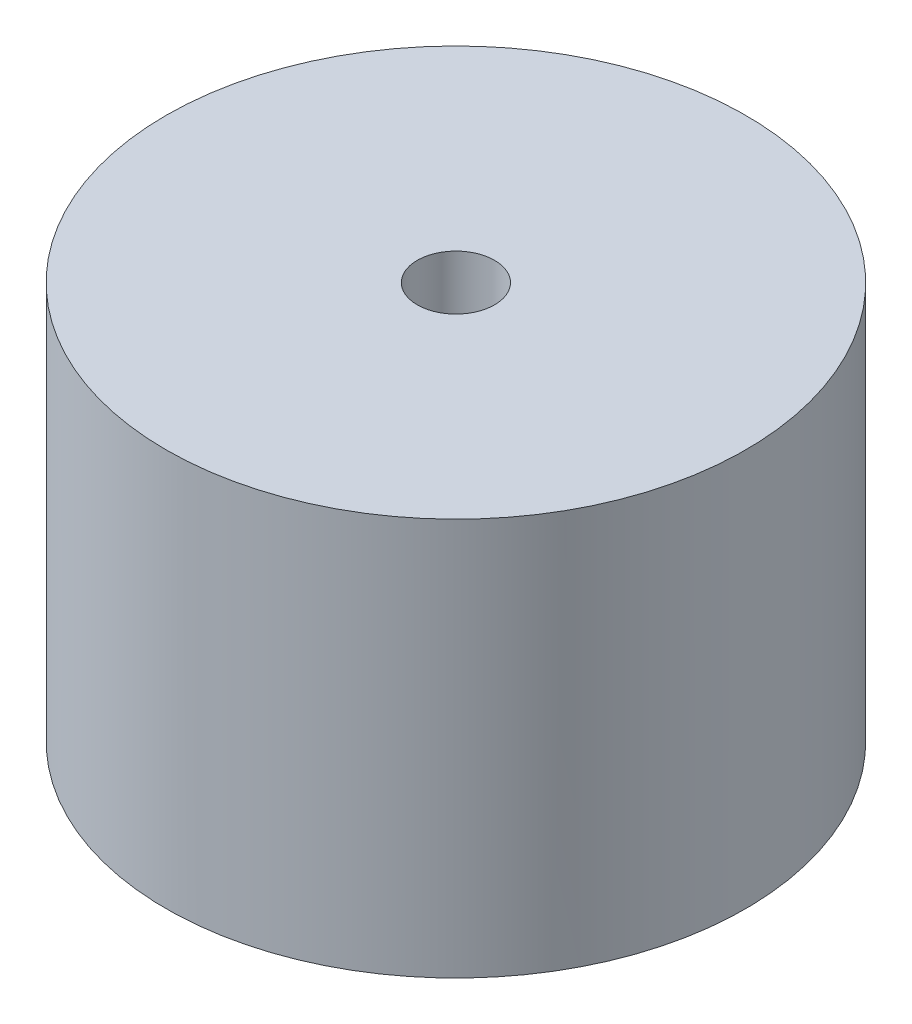
ISO-10303-21;
HEADER;
FILE_DESCRIPTION(('STEP AP214'),'2;1');
FILE_NAME('part.step','',(''),(''),'','','');
FILE_SCHEMA(('AUTOMOTIVE_DESIGN { 1 0 10303 214 1 1 1 1 }'));
ENDSEC;
DATA;
#1=APPLICATION_CONTEXT('core data for automotive mechanical design processes');
#2=APPLICATION_PROTOCOL_DEFINITION('international standard','automotive_design',2000,#1);
#3=PRODUCT_CONTEXT('',#1,'mechanical');
#4=PRODUCT('Part','Part','',(#3));
#5=PRODUCT_RELATED_PRODUCT_CATEGORY('part','',(#4));
#6=PRODUCT_DEFINITION_FORMATION('','',#4);
#7=PRODUCT_DEFINITION_CONTEXT('part definition',#1,'design');
#8=PRODUCT_DEFINITION('design','',#6,#7);
#9=PRODUCT_DEFINITION_SHAPE('','',#8);
#10=(LENGTH_UNIT() NAMED_UNIT(*) SI_UNIT(.MILLI.,.METRE.));
#11=(NAMED_UNIT(*) PLANE_ANGLE_UNIT() SI_UNIT($,.RADIAN.));
#12=(NAMED_UNIT(*) SI_UNIT($,.STERADIAN.) SOLID_ANGLE_UNIT());
#13=UNCERTAINTY_MEASURE_WITH_UNIT(LENGTH_MEASURE(1.E-05),#10,'distance_accuracy_value','');
#14=(GEOMETRIC_REPRESENTATION_CONTEXT(3) GLOBAL_UNCERTAINTY_ASSIGNED_CONTEXT((#13)) GLOBAL_UNIT_ASSIGNED_CONTEXT((#10,
#11,#12)) REPRESENTATION_CONTEXT('',''));
#15=CARTESIAN_POINT('',(0.,0.,0.));
#16=DIRECTION('',(0.,0.,1.));
#17=DIRECTION('',(1.,0.,0.));
#18=AXIS2_PLACEMENT_3D('',#15,#16,#17);
#19=CARTESIAN_POINT('',(0.,0.,0.));
#20=DIRECTION('',(0.,1.,0.));
#21=DIRECTION('',(0.,0.,1.));
#22=AXIS2_PLACEMENT_3D('',#19,#20,#21);
#23=PLANE('',#22);
#24=CARTESIAN_POINT('',(0.,0.,0.));
#25=DIRECTION('',(0.,1.,0.));
#26=DIRECTION('',(0.,0.,1.));
#27=AXIS2_PLACEMENT_3D('',#24,#25,#26);
#28=CIRCLE('',#27,10.125);
#29=CARTESIAN_POINT('',(-9.33487654320988,0.,3.92118667281093));
#30=VERTEX_POINT('',#29);
#31=CARTESIAN_POINT('',(-10.125,0.,0.));
#32=VERTEX_POINT('',#31);
#33=EDGE_CURVE('E98',#30,#32,#28,.T.);
#34=ORIENTED_EDGE('',*,*,#33,.T.);
#35=DIRECTION('',(1.,0.,0.));
#36=VECTOR('',#35,1.);
#37=CARTESIAN_POINT('',(-13.125,0.,0.));
#38=LINE('',#37,#36);
#39=CARTESIAN_POINT('',(-13.125,0.,0.));
#40=VERTEX_POINT('',#39);
#41=EDGE_CURVE('E101',#40,#32,#38,.T.);
#42=ORIENTED_EDGE('',*,*,#41,.F.);
#43=CARTESIAN_POINT('',(0.,0.,0.));
#44=DIRECTION('',(0.,1.,0.));
#45=DIRECTION('',(0.,0.,1.));
#46=AXIS2_PLACEMENT_3D('',#43,#44,#45);
#47=CIRCLE('',#46,13.125);
#48=CARTESIAN_POINT('',(-12.1007658893461,0.,5.0830197610512));
#49=VERTEX_POINT('',#48);
#50=EDGE_CURVE('E100',#49,#40,#47,.T.);
#51=ORIENTED_EDGE('',*,*,#50,.F.);
#52=DIRECTION('',(-0.921963115378753,0.,0.387277696080091));
#53=VECTOR('',#52,1.);
#54=CARTESIAN_POINT('',(-9.33487654320988,0.,3.92118667281093));
#55=LINE('',#54,#53);
#56=EDGE_CURVE('E87',#30,#49,#55,.T.);
#57=ORIENTED_EDGE('',*,*,#56,.F.);
#58=EDGE_LOOP('',(#34,#42,#51,#57));
#59=FACE_BOUND('',#58,.T.);
#60=ADVANCED_FACE('F32',(#59),#23,.F.);
#61=CARTESIAN_POINT('',(0.,15.,0.));
#62=DIRECTION('',(0.,-1.,0.));
#63=DIRECTION('',(0.,0.,-1.));
#64=AXIS2_PLACEMENT_3D('',#61,#62,#63);
#65=CYLINDRICAL_SURFACE('',#64,13.125);
#66=ORIENTED_EDGE('',*,*,#50,.T.);
#67=DIRECTION('',(0.,-1.,0.));
#68=VECTOR('',#67,1.);
#69=CARTESIAN_POINT('',(-13.125,14.,0.));
#70=LINE('',#69,#68);
#71=CARTESIAN_POINT('',(-13.125,12.,0.));
#72=VERTEX_POINT('',#71);
#73=EDGE_CURVE('E156',#72,#40,#70,.T.);
#74=ORIENTED_EDGE('',*,*,#73,.F.);
#75=CARTESIAN_POINT('',(-13.125,12.,0.));
#76=CARTESIAN_POINT('',(-13.1249979172739,12.0562565794863,3.75859197750886E-07));
#77=CARTESIAN_POINT('',(-13.1250002341584,12.1124862113975,0.00237509100152606));
#78=CARTESIAN_POINT('',(-13.1249959122492,12.224543341875,0.0118488139434572));
#79=CARTESIAN_POINT('',(-13.1249892738763,12.2803708592129,0.0189475997516464));
#80=CARTESIAN_POINT('',(-13.1249293619367,12.4465574299383,0.0472634185741115));
#81=CARTESIAN_POINT('',(-13.1248361989639,12.5558037446611,0.0755000947390068));
#82=CARTESIAN_POINT('',(-13.1241959827581,12.7680042654917,0.149909547006922));
#83=CARTESIAN_POINT('',(-13.1236487057189,12.8709553421784,0.196091161149244));
#84=CARTESIAN_POINT('',(-13.121566783017,13.067636122444,0.305071441018353));
#85=CARTESIAN_POINT('',(-13.1200323077121,13.1613674138374,0.367867238583632));
#86=CARTESIAN_POINT('',(-13.1153444762967,13.3368487793729,0.508206408519516));
#87=CARTESIAN_POINT('',(-13.1121927077249,13.4186105019008,0.585735271975528));
#88=CARTESIAN_POINT('',(-13.1036301079183,13.5679431083943,0.753344298497448));
#89=CARTESIAN_POINT('',(-13.0982190546545,13.6355125966508,0.843425694571352));
#90=CARTESIAN_POINT('',(-13.0846217663683,13.7543037455456,1.03309948419919));
#91=CARTESIAN_POINT('',(-13.0764464006927,13.805587931886,1.13265354581684));
#92=CARTESIAN_POINT('',(-13.0569652815386,13.8907694507803,1.33864042900443));
#93=CARTESIAN_POINT('',(-13.0456608627843,13.9246741791429,1.44507030283223));
#94=CARTESIAN_POINT('',(-13.0240071417611,13.9663106589664,1.62675818179965));
#95=CARTESIAN_POINT('',(-13.0145197089574,13.9789528920564,1.70103422369516));
#96=CARTESIAN_POINT('',(-12.9941519205468,13.9957972897955,1.8502331415871));
#97=CARTESIAN_POINT('',(-12.9832736950066,14.0000122003878,1.92515486836819));
#98=CARTESIAN_POINT('',(-12.9717240565778,14.,2.));
#99=B_SPLINE_CURVE_WITH_KNOTS('',3,(#75,#76,#77,#78,#79,#80,#81,#82,#83,#84,#85,#86,#87,#88,#89,
#90,#91,#92,#93,#94,#95,#96,#97,#98),.UNSPECIFIED.,.F.,.F.,(4,2,2,2,2,2,2,2,2,2,2,4),(0.,
0.168666105242437,0.337324285162396,0.674097910918798,1.01103761129856,1.34791918257263,
1.6844707009267,2.02105530133921,2.35633154236122,2.69146498826539,2.9188270646256,
3.1458450052385),.UNSPECIFIED.);
#100=CARTESIAN_POINT('',(-12.9717240565778,14.,2.));
#101=VERTEX_POINT('',#100);
#102=EDGE_CURVE('E130',#72,#101,#99,.T.);
#103=ORIENTED_EDGE('',*,*,#102,.T.);
#104=CARTESIAN_POINT('',(0.,14.,0.));
#105=DIRECTION('',(0.,-1.,0.));
#106=DIRECTION('',(0.,0.,1.));
#107=AXIS2_PLACEMENT_3D('',#104,#105,#106);
#108=CIRCLE('',#107,13.125);
#109=CARTESIAN_POINT('',(-12.7340065151962,14.,3.17973317606066));
#110=VERTEX_POINT('',#109);
#111=EDGE_CURVE('E93',#110,#101,#108,.T.);
#112=ORIENTED_EDGE('',*,*,#111,.F.);
#113=CARTESIAN_POINT('',(-12.7340065151962,14.,3.17973317606066));
#114=CARTESIAN_POINT('',(-12.7203913543842,13.9999996483604,3.23426633810907));
#115=CARTESIAN_POINT('',(-12.7064277403213,13.9976840064101,3.28868675570382));
#116=CARTESIAN_POINT('',(-12.6779063509517,13.9884184202783,3.39697572024695));
#117=CARTESIAN_POINT('',(-12.6633485596645,13.9814683513754,3.45084425230342));
#118=CARTESIAN_POINT('',(-12.6189834491324,13.9536888291794,3.61096822831874));
#119=CARTESIAN_POINT('',(-12.588443054526,13.9259300604946,3.71590710477144));
#120=CARTESIAN_POINT('',(-12.5266572765126,13.8525268778188,3.91915906564674));
#121=CARTESIAN_POINT('',(-12.4954113184536,13.8068673499938,4.01746646861026));
#122=CARTESIAN_POINT('',(-12.4336594941119,13.6988863068943,4.20469434923376));
#123=CARTESIAN_POINT('',(-12.4031534122377,13.6365697104953,4.29361758726672));
#124=CARTESIAN_POINT('',(-12.3445802216906,13.4974448244184,4.45922081160779));
#125=CARTESIAN_POINT('',(-12.3164994849515,13.4207264085094,4.53597155476787));
#126=CARTESIAN_POINT('',(-12.2640363135532,13.2546934465677,4.67596417381264));
#127=CARTESIAN_POINT('',(-12.2396547710809,13.1653758718095,4.73920279228389));
#128=CARTESIAN_POINT('',(-12.1958719989225,12.9764293192384,4.85076757142351));
#129=CARTESIAN_POINT('',(-12.1764846648901,12.8767726309471,4.89905219861599));
#130=CARTESIAN_POINT('',(-12.1438825997099,12.6701783790061,4.97931993972901));
#131=CARTESIAN_POINT('',(-12.1306646051769,12.5632446990342,5.01131167289259));
#132=CARTESIAN_POINT('',(-12.1142504595672,12.3797921932619,5.05082808845507));
#133=CARTESIAN_POINT('',(-12.1092055606383,12.3043794887193,5.06289422922805));
#134=CARTESIAN_POINT('',(-12.1024592241683,12.1526547258065,5.0789886579053));
#135=CARTESIAN_POINT('',(-12.1007533800364,12.0763439866463,5.08302753958873));
#136=CARTESIAN_POINT('',(-12.1007658893461,12.,5.0830197610512));
#137=B_SPLINE_CURVE_WITH_KNOTS('',3,(#113,#114,#115,#116,#117,#118,#119,#120,#121,#122,#123,
#124,#125,#126,#127,#128,#129,#130,#131,#132,#133,#134,#135,#136),.UNSPECIFIED.,.F.,.F.,(4,2,2,
2,2,2,2,2,2,2,2,4),(0.,0.168521660518903,0.337047856462602,0.673596240843321,1.01042939129115,
1.34716318371462,1.6818615460783,2.01664050449493,2.35234111362858,2.6878639459597,
2.9170083477776,3.14585014053042),.UNSPECIFIED.);
#138=CARTESIAN_POINT('',(-12.1007658893461,12.,5.0830197610512));
#139=VERTEX_POINT('',#138);
#140=EDGE_CURVE('E45',#110,#139,#137,.T.);
#141=ORIENTED_EDGE('',*,*,#140,.T.);
#142=DIRECTION('',(0.,-1.,0.));
#143=VECTOR('',#142,1.);
#144=CARTESIAN_POINT('',(-12.1007658893461,14.,5.0830197610512));
#145=LINE('',#144,#143);
#146=EDGE_CURVE('E92',#139,#49,#145,.T.);
#147=ORIENTED_EDGE('',*,*,#146,.T.);
#148=EDGE_LOOP('',(#66,#74,#103,#112,#141,#147));
#149=FACE_BOUND('',#148,.T.);
#150=CARTESIAN_POINT('',(0.,18.,0.));
#151=DIRECTION('',(0.,1.,0.));
#152=DIRECTION('',(0.,0.,1.));
#153=AXIS2_PLACEMENT_3D('',#150,#151,#152);
#154=CIRCLE('',#153,13.125);
#155=CARTESIAN_POINT('',(0.,18.,13.125));
#156=VERTEX_POINT('',#155);
#157=EDGE_CURVE('E113',#156,#156,#154,.T.);
#158=ORIENTED_EDGE('',*,*,#157,.F.);
#159=EDGE_LOOP('',(#158));
#160=FACE_BOUND('',#159,.T.);
#161=ADVANCED_FACE('F142',(#149,#160),#65,.T.);
#162=CARTESIAN_POINT('',(0.,15.,0.));
#163=DIRECTION('',(0.,-1.,0.));
#164=DIRECTION('',(0.,0.,-1.));
#165=AXIS2_PLACEMENT_3D('',#162,#163,#164);
#166=CYLINDRICAL_SURFACE('',#165,10.125);
#167=DIRECTION('',(0.,-1.,0.));
#168=VECTOR('',#167,1.);
#169=CARTESIAN_POINT('',(-9.33487654320988,14.,3.92118667281093));
#170=LINE('',#169,#168);
#171=CARTESIAN_POINT('',(-9.33487654320988,12.,3.92118667281093));
#172=VERTEX_POINT('',#171);
#173=EDGE_CURVE('E84',#172,#30,#170,.T.);
#174=ORIENTED_EDGE('',*,*,#173,.F.);
#175=CARTESIAN_POINT('',(-9.33487654320988,12.,3.92118667281093));
#176=CARTESIAN_POINT('',(-9.33487420170574,12.0562477801141,3.92118528036678));
#177=CARTESIAN_POINT('',(-9.33579635494198,12.1124686193919,3.91899772907976));
#178=CARTESIAN_POINT('',(-9.33945900933961,12.2245083889204,3.91026386348231));
#179=CARTESIAN_POINT('',(-9.34219942626762,12.280327337668,3.90371775108769));
#180=CARTESIAN_POINT('',(-9.35309075038475,12.4464918267623,3.87758917280323));
#181=CARTESIAN_POINT('',(-9.36391192597525,12.5557250819143,3.85151635458613));
#182=CARTESIAN_POINT('',(-9.39195673057606,12.7679024174701,3.78261037488589));
#183=CARTESIAN_POINT('',(-9.40918356954466,12.8708433145288,3.73976880980584));
#184=CARTESIAN_POINT('',(-9.44889064146861,13.0675031458217,3.63827544703169));
#185=CARTESIAN_POINT('',(-9.47136997889439,13.161223648229,3.57962634419693));
#186=CARTESIAN_POINT('',(-9.52008215851996,13.3366157142388,3.44797963328651));
#187=CARTESIAN_POINT('',(-9.54630879382089,13.4183067574691,3.37500567913258));
#188=CARTESIAN_POINT('',(-9.60089943964841,13.5674929347915,3.21642184935259));
#189=CARTESIAN_POINT('',(-9.6292635204153,13.6349876020887,3.13081155838506));
#190=CARTESIAN_POINT('',(-9.68623967614509,13.7534740148422,2.94979998839365));
#191=CARTESIAN_POINT('',(-9.71484885847452,13.8045722486949,2.85446741540273));
#192=CARTESIAN_POINT('',(-9.77094225240849,13.8895350805804,2.65610831164842));
#193=CARTESIAN_POINT('',(-9.79842681905313,13.9234051567339,2.55308423855275));
#194=CARTESIAN_POINT('',(-9.84287749626255,13.9655499486967,2.37467069308912));
#195=CARTESIAN_POINT('',(-9.8604831057876,13.9784896706347,2.30050324607049));
#196=CARTESIAN_POINT('',(-9.8941874992791,13.9957150764435,2.15095596350158));
#197=CARTESIAN_POINT('',(-9.91028861274981,14.000014357892,2.07557822137205));
#198=CARTESIAN_POINT('',(-9.92550376555266,14.,2.));
#199=B_SPLINE_CURVE_WITH_KNOTS('',3,(#175,#176,#177,#178,#179,#180,#181,#182,#183,#184,#185,
#186,#187,#188,#189,#190,#191,#192,#193,#194,#195,#196,#197,#198),.UNSPECIFIED.,.F.,.F.,(4,2,2,
2,2,2,2,2,2,2,2,4),(0.,0.16863974358449,0.337271675264135,0.674002193443286,1.0109016794123,
1.34774376725147,1.68403425341544,2.02033579551312,2.35440677752429,2.68837146685923,
2.91984714831114,3.15095826722036),.UNSPECIFIED.);
#200=CARTESIAN_POINT('',(-9.92550376555266,14.,2.));
#201=VERTEX_POINT('',#200);
#202=EDGE_CURVE('E11',#172,#201,#199,.T.);
#203=ORIENTED_EDGE('',*,*,#202,.T.);
#204=CARTESIAN_POINT('',(-9.92550376555266,14.,2.));
#205=CARTESIAN_POINT('',(-9.93660049230625,13.99999965337,1.94494195846542));
#206=CARTESIAN_POINT('',(-9.94722906458446,13.9977247789891,1.88981375124258));
#207=CARTESIAN_POINT('',(-9.96750880905469,13.9886035371357,1.77975235708469));
#208=CARTESIAN_POINT('',(-9.97715990648119,13.9817568202739,1.72481918537723));
#209=CARTESIAN_POINT('',(-10.0045575405807,13.954351128779,1.56097964916793));
#210=CARTESIAN_POINT('',(-10.0207794331028,13.926926718144,1.45287863493161));
#211=CARTESIAN_POINT('',(-10.0490752326504,13.8542335514719,1.24219720451805));
#212=CARTESIAN_POINT('',(-10.0611445968299,13.8089453680364,1.13962293734918));
#213=CARTESIAN_POINT('',(-10.0814535382429,13.7016833533655,0.943221360053734));
#214=CARTESIAN_POINT('',(-10.0896945568552,13.6397158158381,0.84939076857169));
#215=CARTESIAN_POINT('',(-10.1029078590091,13.5015203667185,0.674193187248347));
#216=CARTESIAN_POINT('',(-10.1079122821419,13.4254426363841,0.592710002407782));
#217=CARTESIAN_POINT('',(-10.1155620015331,13.2607329110565,0.443430869991642));
#218=CARTESIAN_POINT('',(-10.1182066578884,13.172097518321,0.375638638874696));
#219=CARTESIAN_POINT('',(-10.1219573089035,12.9843770847599,0.255442014154371));
#220=CARTESIAN_POINT('',(-10.1230565157712,12.8852479890281,0.203106296478694));
#221=CARTESIAN_POINT('',(-10.1244334761901,12.6796630053011,0.11571813149887));
#222=CARTESIAN_POINT('',(-10.1247116328152,12.5732107387074,0.0806572106141052));
#223=CARTESIAN_POINT('',(-10.1249505756898,12.3885609827143,0.0365469743669848));
#224=CARTESIAN_POINT('',(-10.1249814186334,12.3114393946313,0.0228536548147684));
#225=CARTESIAN_POINT('',(-10.1250000039558,12.15622205563,0.00457881934267489));
#226=CARTESIAN_POINT('',(-10.1249878000466,12.0781276397816,-1.40405361818182E-05));
#227=CARTESIAN_POINT('',(-10.125,12.,0.));
#228=B_SPLINE_CURVE_WITH_KNOTS('',3,(#204,#205,#206,#207,#208,#209,#210,#211,#212,#213,#214,
#215,#216,#217,#218,#219,#220,#221,#222,#223,#224,#225,#226,#227),.UNSPECIFIED.,.F.,.F.,(4,2,2,
2,2,2,2,2,2,2,2,4),(0.,0.168398441535562,0.336809753891384,0.673165194223132,1.00988744439227,
1.34648281507853,1.67968225777422,2.01297202744127,2.34772111926362,2.68230584710594,
2.91678229939042,3.15096628636005),.UNSPECIFIED.);
#229=CARTESIAN_POINT('',(-10.125,12.,0.));
#230=VERTEX_POINT('',#229);
#231=EDGE_CURVE('E125',#201,#230,#228,.T.);
#232=ORIENTED_EDGE('',*,*,#231,.T.);
#233=DIRECTION('',(0.,-1.,0.));
#234=VECTOR('',#233,1.);
#235=CARTESIAN_POINT('',(-10.125,14.,0.));
#236=LINE('',#235,#234);
#237=EDGE_CURVE('E106',#230,#32,#236,.T.);
#238=ORIENTED_EDGE('',*,*,#237,.T.);
#239=ORIENTED_EDGE('',*,*,#33,.F.);
#240=EDGE_LOOP('',(#174,#203,#232,#238,#239));
#241=FACE_BOUND('',#240,.T.);
#242=CARTESIAN_POINT('',(0.,15.,0.));
#243=DIRECTION('',(0.,1.,0.));
#244=DIRECTION('',(0.,0.,1.));
#245=AXIS2_PLACEMENT_3D('',#242,#243,#244);
#246=CIRCLE('',#245,10.125);
#247=CARTESIAN_POINT('',(0.,15.,10.125));
#248=VERTEX_POINT('',#247);
#249=EDGE_CURVE('E108',#248,#248,#246,.T.);
#250=ORIENTED_EDGE('',*,*,#249,.T.);
#251=EDGE_LOOP('',(#250));
#252=FACE_BOUND('',#251,.T.);
#253=ADVANCED_FACE('F103',(#241,#252),#166,.F.);
#254=CARTESIAN_POINT('',(0.,15.,0.));
#255=DIRECTION('',(0.,1.,0.));
#256=DIRECTION('',(0.,0.,1.));
#257=AXIS2_PLACEMENT_3D('',#254,#255,#256);
#258=PLANE('',#257);
#259=CARTESIAN_POINT('',(0.,15.,0.));
#260=DIRECTION('',(0.,1.,0.));
#261=DIRECTION('',(0.,0.,1.));
#262=AXIS2_PLACEMENT_3D('',#259,#260,#261);
#263=CIRCLE('',#262,1.75);
#264=CARTESIAN_POINT('',(0.,15.,1.75));
#265=VERTEX_POINT('',#264);
#266=EDGE_CURVE('E198',#265,#265,#263,.T.);
#267=ORIENTED_EDGE('',*,*,#266,.T.);
#268=EDGE_LOOP('',(#267));
#269=FACE_BOUND('',#268,.T.);
#270=ORIENTED_EDGE('',*,*,#249,.F.);
#271=EDGE_LOOP('',(#270));
#272=FACE_BOUND('',#271,.T.);
#273=ADVANCED_FACE('F141',(#269,#272),#258,.F.);
#274=CARTESIAN_POINT('',(0.,18.,0.));
#275=DIRECTION('',(0.,1.,0.));
#276=DIRECTION('',(0.,0.,1.));
#277=AXIS2_PLACEMENT_3D('',#274,#275,#276);
#278=PLANE('',#277);
#279=ORIENTED_EDGE('',*,*,#157,.T.);
#280=EDGE_LOOP('',(#279));
#281=FACE_BOUND('',#280,.T.);
#282=CARTESIAN_POINT('',(0.,18.,0.));
#283=DIRECTION('',(0.,1.,0.));
#284=DIRECTION('',(0.,0.,1.));
#285=AXIS2_PLACEMENT_3D('',#282,#283,#284);
#286=CIRCLE('',#285,1.75);
#287=CARTESIAN_POINT('',(0.,18.,1.75));
#288=VERTEX_POINT('',#287);
#289=EDGE_CURVE('E197',#288,#288,#286,.T.);
#290=ORIENTED_EDGE('',*,*,#289,.F.);
#291=EDGE_LOOP('',(#290));
#292=FACE_BOUND('',#291,.T.);
#293=ADVANCED_FACE('F184',(#281,#292),#278,.T.);
#294=CARTESIAN_POINT('',(0.,18.,0.));
#295=DIRECTION('',(0.,-1.,0.));
#296=DIRECTION('',(0.,0.,-1.));
#297=AXIS2_PLACEMENT_3D('',#294,#295,#296);
#298=CYLINDRICAL_SURFACE('',#297,1.75);
#299=ORIENTED_EDGE('',*,*,#289,.T.);
#300=EDGE_LOOP('',(#299));
#301=FACE_BOUND('',#300,.T.);
#302=ORIENTED_EDGE('',*,*,#266,.F.);
#303=EDGE_LOOP('',(#302));
#304=FACE_BOUND('',#303,.T.);
#305=ADVANCED_FACE('F180',(#301,#304),#298,.F.);
#306=CARTESIAN_POINT('',(-13.125,14.,0.));
#307=DIRECTION('',(0.,0.,-1.));
#308=DIRECTION('',(-1.,0.,0.));
#309=AXIS2_PLACEMENT_3D('',#306,#307,#308);
#310=PLANE('',#309);
#311=ORIENTED_EDGE('',*,*,#237,.F.);
#312=DIRECTION('',(1.,0.,0.));
#313=VECTOR('',#312,1.);
#314=CARTESIAN_POINT('',(-13.125,12.,0.));
#315=LINE('',#314,#313);
#316=EDGE_CURVE('E122',#230,#72,#315,.F.);
#317=ORIENTED_EDGE('',*,*,#316,.T.);
#318=ORIENTED_EDGE('',*,*,#73,.T.);
#319=ORIENTED_EDGE('',*,*,#41,.T.);
#320=EDGE_LOOP('',(#311,#317,#318,#319));
#321=FACE_BOUND('',#320,.T.);
#322=ADVANCED_FACE('F176',(#321),#310,.F.);
#323=CARTESIAN_POINT('',(-9.33487654320988,14.,3.92118667281093));
#324=DIRECTION('',(0.387277696080091,0.,0.921963115378753));
#325=DIRECTION('',(0.921963115378753,0.,-0.387277696080091));
#326=AXIS2_PLACEMENT_3D('',#323,#324,#325);
#327=PLANE('',#326);
#328=ORIENTED_EDGE('',*,*,#146,.F.);
#329=DIRECTION('',(-0.921963115378753,0.,0.387277696080091));
#330=VECTOR('',#329,1.);
#331=CARTESIAN_POINT('',(-9.33487654320988,12.,3.92118667281093));
#332=LINE('',#331,#330);
#333=EDGE_CURVE('E52',#139,#172,#332,.F.);
#334=ORIENTED_EDGE('',*,*,#333,.T.);
#335=ORIENTED_EDGE('',*,*,#173,.T.);
#336=ORIENTED_EDGE('',*,*,#56,.T.);
#337=EDGE_LOOP('',(#328,#334,#335,#336));
#338=FACE_BOUND('',#337,.T.);
#339=ADVANCED_FACE('F86',(#338),#327,.F.);
#340=CARTESIAN_POINT('',(0.,14.,0.));
#341=DIRECTION('',(0.,1.,0.));
#342=DIRECTION('',(0.,0.,1.));
#343=AXIS2_PLACEMENT_3D('',#340,#341,#342);
#344=PLANE('',#343);
#345=ORIENTED_EDGE('',*,*,#111,.T.);
#346=DIRECTION('',(1.,0.,0.));
#347=VECTOR('',#346,1.);
#348=CARTESIAN_POINT('',(-10.125,14.,2.));
#349=LINE('',#348,#347);
#350=EDGE_CURVE('E119',#101,#201,#349,.T.);
#351=ORIENTED_EDGE('',*,*,#350,.T.);
#352=DIRECTION('',(-0.921963115378753,0.,0.387277696080091));
#353=VECTOR('',#352,1.);
#354=CARTESIAN_POINT('',(-12.8753212815063,14.,3.2390935302937));
#355=LINE('',#354,#353);
#356=EDGE_CURVE('E110',#201,#110,#355,.T.);
#357=ORIENTED_EDGE('',*,*,#356,.T.);
#358=EDGE_LOOP('',(#345,#351,#357));
#359=FACE_BOUND('',#358,.T.);
#360=ADVANCED_FACE('F161',(#359),#344,.F.);
#361=CARTESIAN_POINT('',(0.,12.,2.));
#362=DIRECTION('',(-1.,0.,0.));
#363=DIRECTION('',(0.,0.,1.));
#364=AXIS2_PLACEMENT_3D('',#361,#362,#363);
#365=CYLINDRICAL_SURFACE('',#364,2.);
#366=ORIENTED_EDGE('',*,*,#102,.F.);
#367=ORIENTED_EDGE('',*,*,#316,.F.);
#368=ORIENTED_EDGE('',*,*,#231,.F.);
#369=ORIENTED_EDGE('',*,*,#350,.F.);
#370=EDGE_LOOP('',(#366,#367,#368,#369));
#371=FACE_BOUND('',#370,.T.);
#372=ADVANCED_FACE('F135',(#371),#365,.F.);
#373=CARTESIAN_POINT('',(-0.774555392160182,12.,-1.84392623075751));
#374=DIRECTION('',(0.921963115378753,0.,-0.387277696080091));
#375=DIRECTION('',(-0.387277696080091,0.,-0.921963115378753));
#376=AXIS2_PLACEMENT_3D('',#373,#374,#375);
#377=CYLINDRICAL_SURFACE('',#376,2.);
#378=ORIENTED_EDGE('',*,*,#202,.F.);
#379=ORIENTED_EDGE('',*,*,#333,.F.);
#380=ORIENTED_EDGE('',*,*,#140,.F.);
#381=ORIENTED_EDGE('',*,*,#356,.F.);
#382=EDGE_LOOP('',(#378,#379,#380,#381));
#383=FACE_BOUND('',#382,.T.);
#384=ADVANCED_FACE('F34',(#383),#377,.F.);
#385=CLOSED_SHELL('',(#60,#161,#253,#273,#293,#305,#322,#339,#360,#372,#384));
#386=MANIFOLD_SOLID_BREP('B2',#385);
#387=ADVANCED_BREP_SHAPE_REPRESENTATION('',(#18,#386),#14);
#388=SHAPE_DEFINITION_REPRESENTATION(#9,#387);
ENDSEC;
END-ISO-10303-21;
